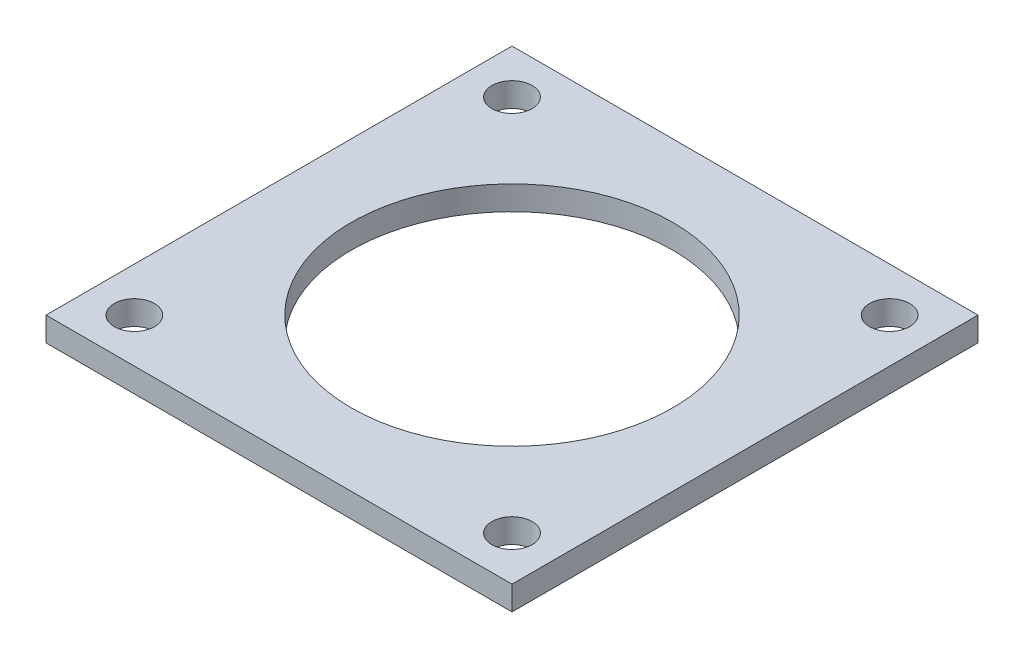
ISO-10303-21;
HEADER;
FILE_DESCRIPTION(('STEP AP214'),'2;1');
FILE_NAME('part.step','',(''),(''),'','','');
FILE_SCHEMA(('AUTOMOTIVE_DESIGN { 1 0 10303 214 1 1 1 1 }'));
ENDSEC;
DATA;
#1=APPLICATION_CONTEXT('core data for automotive mechanical design processes');
#2=APPLICATION_PROTOCOL_DEFINITION('international standard','automotive_design',2000,#1);
#3=PRODUCT_CONTEXT('',#1,'mechanical');
#4=PRODUCT('Part','Part','',(#3));
#5=PRODUCT_RELATED_PRODUCT_CATEGORY('part','',(#4));
#6=PRODUCT_DEFINITION_FORMATION('','',#4);
#7=PRODUCT_DEFINITION_CONTEXT('part definition',#1,'design');
#8=PRODUCT_DEFINITION('design','',#6,#7);
#9=PRODUCT_DEFINITION_SHAPE('','',#8);
#10=(LENGTH_UNIT() NAMED_UNIT(*) SI_UNIT(.MILLI.,.METRE.));
#11=(NAMED_UNIT(*) PLANE_ANGLE_UNIT() SI_UNIT($,.RADIAN.));
#12=(NAMED_UNIT(*) SI_UNIT($,.STERADIAN.) SOLID_ANGLE_UNIT());
#13=UNCERTAINTY_MEASURE_WITH_UNIT(LENGTH_MEASURE(1.E-05),#10,'distance_accuracy_value','');
#14=(GEOMETRIC_REPRESENTATION_CONTEXT(3) GLOBAL_UNCERTAINTY_ASSIGNED_CONTEXT((#13)) GLOBAL_UNIT_ASSIGNED_CONTEXT((#10,
#11,#12)) REPRESENTATION_CONTEXT('',''));
#15=CARTESIAN_POINT('',(0.,0.,0.));
#16=DIRECTION('',(0.,0.,1.));
#17=DIRECTION('',(1.,0.,0.));
#18=AXIS2_PLACEMENT_3D('',#15,#16,#17);
#19=CARTESIAN_POINT('',(0.,3.,0.));
#20=DIRECTION('',(0.,1.,0.));
#21=DIRECTION('',(0.,0.,1.));
#22=AXIS2_PLACEMENT_3D('',#19,#20,#21);
#23=PLANE('',#22);
#24=CARTESIAN_POINT('',(52.5,3.,52.5));
#25=DIRECTION('',(0.,1.,0.));
#26=DIRECTION('',(0.,0.,1.));
#27=AXIS2_PLACEMENT_3D('',#24,#25,#26);
#28=CIRCLE('',#27,2.5);
#29=CARTESIAN_POINT('',(52.5,3.,55.));
#30=VERTEX_POINT('',#29);
#31=EDGE_CURVE('E127',#30,#30,#28,.T.);
#32=ORIENTED_EDGE('',*,*,#31,.F.);
#33=EDGE_LOOP('',(#32));
#34=FACE_BOUND('',#33,.T.);
#35=CARTESIAN_POINT('',(5.5,3.,5.5));
#36=DIRECTION('',(0.,1.,0.));
#37=DIRECTION('',(0.,0.,1.));
#38=AXIS2_PLACEMENT_3D('',#35,#36,#37);
#39=CIRCLE('',#38,2.5);
#40=CARTESIAN_POINT('',(5.5,3.,8.));
#41=VERTEX_POINT('',#40);
#42=EDGE_CURVE('E115',#41,#41,#39,.T.);
#43=ORIENTED_EDGE('',*,*,#42,.F.);
#44=EDGE_LOOP('',(#43));
#45=FACE_BOUND('',#44,.T.);
#46=DIRECTION('',(0.,0.,1.));
#47=VECTOR('',#46,1.);
#48=CARTESIAN_POINT('',(0.,3.,0.));
#49=LINE('',#48,#47);
#50=CARTESIAN_POINT('',(0.,3.,0.));
#51=VERTEX_POINT('',#50);
#52=CARTESIAN_POINT('',(0.,3.,58.));
#53=VERTEX_POINT('',#52);
#54=EDGE_CURVE('E85',#51,#53,#49,.T.);
#55=ORIENTED_EDGE('',*,*,#54,.T.);
#56=DIRECTION('',(1.,0.,0.));
#57=VECTOR('',#56,1.);
#58=CARTESIAN_POINT('',(0.,3.,58.));
#59=LINE('',#58,#57);
#60=CARTESIAN_POINT('',(58.,3.,58.));
#61=VERTEX_POINT('',#60);
#62=EDGE_CURVE('E80',#53,#61,#59,.T.);
#63=ORIENTED_EDGE('',*,*,#62,.T.);
#64=DIRECTION('',(0.,0.,-1.));
#65=VECTOR('',#64,1.);
#66=CARTESIAN_POINT('',(58.,3.,0.));
#67=LINE('',#66,#65);
#68=CARTESIAN_POINT('',(58.,3.,0.));
#69=VERTEX_POINT('',#68);
#70=EDGE_CURVE('E83',#61,#69,#67,.T.);
#71=ORIENTED_EDGE('',*,*,#70,.T.);
#72=DIRECTION('',(-1.,0.,0.));
#73=VECTOR('',#72,1.);
#74=CARTESIAN_POINT('',(0.,3.,0.));
#75=LINE('',#74,#73);
#76=EDGE_CURVE('E50',#69,#51,#75,.T.);
#77=ORIENTED_EDGE('',*,*,#76,.T.);
#78=EDGE_LOOP('',(#55,#63,#71,#77));
#79=FACE_BOUND('',#78,.T.);
#80=CARTESIAN_POINT('',(29.,3.,29.));
#81=DIRECTION('',(0.,1.,0.));
#82=DIRECTION('',(0.,0.,1.));
#83=AXIS2_PLACEMENT_3D('',#80,#81,#82);
#84=CIRCLE('',#83,20.);
#85=CARTESIAN_POINT('',(29.,3.,49.));
#86=VERTEX_POINT('',#85);
#87=EDGE_CURVE('E100',#86,#86,#84,.T.);
#88=ORIENTED_EDGE('',*,*,#87,.F.);
#89=EDGE_LOOP('',(#88));
#90=FACE_BOUND('',#89,.T.);
#91=CARTESIAN_POINT('',(52.5,3.,5.5));
#92=DIRECTION('',(0.,1.,0.));
#93=DIRECTION('',(0.,0.,-1.));
#94=AXIS2_PLACEMENT_3D('',#91,#92,#93);
#95=CIRCLE('',#94,2.5);
#96=CARTESIAN_POINT('',(52.5,3.,3.));
#97=VERTEX_POINT('',#96);
#98=EDGE_CURVE('E121',#97,#97,#95,.T.);
#99=ORIENTED_EDGE('',*,*,#98,.F.);
#100=EDGE_LOOP('',(#99));
#101=FACE_BOUND('',#100,.T.);
#102=CARTESIAN_POINT('',(5.5,3.,52.5));
#103=DIRECTION('',(0.,1.,0.));
#104=DIRECTION('',(0.,0.,-1.));
#105=AXIS2_PLACEMENT_3D('',#102,#103,#104);
#106=CIRCLE('',#105,2.5);
#107=CARTESIAN_POINT('',(5.5,3.,50.));
#108=VERTEX_POINT('',#107);
#109=EDGE_CURVE('E133',#108,#108,#106,.T.);
#110=ORIENTED_EDGE('',*,*,#109,.F.);
#111=EDGE_LOOP('',(#110));
#112=FACE_BOUND('',#111,.T.);
#113=ADVANCED_FACE('F33',(#34,#45,#79,#90,#101,#112),#23,.T.);
#114=CARTESIAN_POINT('',(0.,0.,0.));
#115=DIRECTION('',(0.,1.,0.));
#116=DIRECTION('',(0.,0.,1.));
#117=AXIS2_PLACEMENT_3D('',#114,#115,#116);
#118=PLANE('',#117);
#119=CARTESIAN_POINT('',(52.5,0.,52.5));
#120=DIRECTION('',(0.,1.,0.));
#121=DIRECTION('',(0.,0.,1.));
#122=AXIS2_PLACEMENT_3D('',#119,#120,#121);
#123=CIRCLE('',#122,2.5);
#124=CARTESIAN_POINT('',(52.5,0.,55.));
#125=VERTEX_POINT('',#124);
#126=EDGE_CURVE('E130',#125,#125,#123,.T.);
#127=ORIENTED_EDGE('',*,*,#126,.T.);
#128=EDGE_LOOP('',(#127));
#129=FACE_BOUND('',#128,.T.);
#130=CARTESIAN_POINT('',(5.5,0.,5.5));
#131=DIRECTION('',(0.,1.,0.));
#132=DIRECTION('',(0.,0.,1.));
#133=AXIS2_PLACEMENT_3D('',#130,#131,#132);
#134=CIRCLE('',#133,2.5);
#135=CARTESIAN_POINT('',(5.5,0.,8.));
#136=VERTEX_POINT('',#135);
#137=EDGE_CURVE('E118',#136,#136,#134,.T.);
#138=ORIENTED_EDGE('',*,*,#137,.T.);
#139=EDGE_LOOP('',(#138));
#140=FACE_BOUND('',#139,.T.);
#141=DIRECTION('',(0.,0.,1.));
#142=VECTOR('',#141,1.);
#143=CARTESIAN_POINT('',(0.,0.,0.));
#144=LINE('',#143,#142);
#145=CARTESIAN_POINT('',(0.,0.,0.));
#146=VERTEX_POINT('',#145);
#147=CARTESIAN_POINT('',(0.,0.,58.));
#148=VERTEX_POINT('',#147);
#149=EDGE_CURVE('E97',#146,#148,#144,.T.);
#150=ORIENTED_EDGE('',*,*,#149,.F.);
#151=DIRECTION('',(-1.,0.,0.));
#152=VECTOR('',#151,1.);
#153=CARTESIAN_POINT('',(0.,0.,0.));
#154=LINE('',#153,#152);
#155=CARTESIAN_POINT('',(58.,0.,0.));
#156=VERTEX_POINT('',#155);
#157=EDGE_CURVE('E73',#156,#146,#154,.T.);
#158=ORIENTED_EDGE('',*,*,#157,.F.);
#159=DIRECTION('',(0.,0.,-1.));
#160=VECTOR('',#159,1.);
#161=CARTESIAN_POINT('',(58.,0.,0.));
#162=LINE('',#161,#160);
#163=CARTESIAN_POINT('',(58.,0.,58.));
#164=VERTEX_POINT('',#163);
#165=EDGE_CURVE('E67',#164,#156,#162,.T.);
#166=ORIENTED_EDGE('',*,*,#165,.F.);
#167=DIRECTION('',(1.,0.,0.));
#168=VECTOR('',#167,1.);
#169=CARTESIAN_POINT('',(0.,0.,58.));
#170=LINE('',#169,#168);
#171=EDGE_CURVE('E89',#148,#164,#170,.T.);
#172=ORIENTED_EDGE('',*,*,#171,.F.);
#173=EDGE_LOOP('',(#150,#158,#166,#172));
#174=FACE_BOUND('',#173,.T.);
#175=CARTESIAN_POINT('',(29.,0.,29.));
#176=DIRECTION('',(0.,1.,0.));
#177=DIRECTION('',(0.,0.,1.));
#178=AXIS2_PLACEMENT_3D('',#175,#176,#177);
#179=CIRCLE('',#178,20.);
#180=CARTESIAN_POINT('',(29.,0.,49.));
#181=VERTEX_POINT('',#180);
#182=EDGE_CURVE('E112',#181,#181,#179,.T.);
#183=ORIENTED_EDGE('',*,*,#182,.T.);
#184=EDGE_LOOP('',(#183));
#185=FACE_BOUND('',#184,.T.);
#186=CARTESIAN_POINT('',(52.5,0.,5.5));
#187=DIRECTION('',(0.,1.,0.));
#188=DIRECTION('',(0.,0.,-1.));
#189=AXIS2_PLACEMENT_3D('',#186,#187,#188);
#190=CIRCLE('',#189,2.5);
#191=CARTESIAN_POINT('',(52.5,0.,3.));
#192=VERTEX_POINT('',#191);
#193=EDGE_CURVE('E124',#192,#192,#190,.T.);
#194=ORIENTED_EDGE('',*,*,#193,.T.);
#195=EDGE_LOOP('',(#194));
#196=FACE_BOUND('',#195,.T.);
#197=CARTESIAN_POINT('',(5.5,0.,52.5));
#198=DIRECTION('',(0.,1.,0.));
#199=DIRECTION('',(0.,0.,-1.));
#200=AXIS2_PLACEMENT_3D('',#197,#198,#199);
#201=CIRCLE('',#200,2.5);
#202=CARTESIAN_POINT('',(5.5,0.,50.));
#203=VERTEX_POINT('',#202);
#204=EDGE_CURVE('E136',#203,#203,#201,.T.);
#205=ORIENTED_EDGE('',*,*,#204,.T.);
#206=EDGE_LOOP('',(#205));
#207=FACE_BOUND('',#206,.T.);
#208=ADVANCED_FACE('F108',(#129,#140,#174,#185,#196,#207),#118,.F.);
#209=CARTESIAN_POINT('',(0.,3.,0.));
#210=DIRECTION('',(1.,0.,0.));
#211=DIRECTION('',(0.,0.,-1.));
#212=AXIS2_PLACEMENT_3D('',#209,#210,#211);
#213=PLANE('',#212);
#214=ORIENTED_EDGE('',*,*,#149,.T.);
#215=DIRECTION('',(0.,-1.,0.));
#216=VECTOR('',#215,1.);
#217=CARTESIAN_POINT('',(0.,3.,58.));
#218=LINE('',#217,#216);
#219=EDGE_CURVE('E11',#53,#148,#218,.T.);
#220=ORIENTED_EDGE('',*,*,#219,.F.);
#221=ORIENTED_EDGE('',*,*,#54,.F.);
#222=DIRECTION('',(0.,-1.,0.));
#223=VECTOR('',#222,1.);
#224=CARTESIAN_POINT('',(0.,3.,0.));
#225=LINE('',#224,#223);
#226=EDGE_CURVE('E93',#51,#146,#225,.T.);
#227=ORIENTED_EDGE('',*,*,#226,.T.);
#228=EDGE_LOOP('',(#214,#220,#221,#227));
#229=FACE_BOUND('',#228,.T.);
#230=ADVANCED_FACE('F35',(#229),#213,.F.);
#231=CARTESIAN_POINT('',(0.,3.,58.));
#232=DIRECTION('',(0.,0.,-1.));
#233=DIRECTION('',(-1.,0.,0.));
#234=AXIS2_PLACEMENT_3D('',#231,#232,#233);
#235=PLANE('',#234);
#236=ORIENTED_EDGE('',*,*,#171,.T.);
#237=DIRECTION('',(0.,-1.,0.));
#238=VECTOR('',#237,1.);
#239=CARTESIAN_POINT('',(58.,3.,58.));
#240=LINE('',#239,#238);
#241=EDGE_CURVE('E42',#61,#164,#240,.T.);
#242=ORIENTED_EDGE('',*,*,#241,.F.);
#243=ORIENTED_EDGE('',*,*,#62,.F.);
#244=ORIENTED_EDGE('',*,*,#219,.T.);
#245=EDGE_LOOP('',(#236,#242,#243,#244));
#246=FACE_BOUND('',#245,.T.);
#247=ADVANCED_FACE('F88',(#246),#235,.F.);
#248=CARTESIAN_POINT('',(58.,3.,0.));
#249=DIRECTION('',(-1.,0.,0.));
#250=DIRECTION('',(0.,0.,1.));
#251=AXIS2_PLACEMENT_3D('',#248,#249,#250);
#252=PLANE('',#251);
#253=ORIENTED_EDGE('',*,*,#165,.T.);
#254=DIRECTION('',(0.,-1.,0.));
#255=VECTOR('',#254,1.);
#256=CARTESIAN_POINT('',(58.,3.,0.));
#257=LINE('',#256,#255);
#258=EDGE_CURVE('E90',#69,#156,#257,.T.);
#259=ORIENTED_EDGE('',*,*,#258,.F.);
#260=ORIENTED_EDGE('',*,*,#70,.F.);
#261=ORIENTED_EDGE('',*,*,#241,.T.);
#262=EDGE_LOOP('',(#253,#259,#260,#261));
#263=FACE_BOUND('',#262,.T.);
#264=ADVANCED_FACE('F91',(#263),#252,.F.);
#265=CARTESIAN_POINT('',(0.,3.,0.));
#266=DIRECTION('',(0.,0.,1.));
#267=DIRECTION('',(1.,0.,0.));
#268=AXIS2_PLACEMENT_3D('',#265,#266,#267);
#269=PLANE('',#268);
#270=ORIENTED_EDGE('',*,*,#157,.T.);
#271=ORIENTED_EDGE('',*,*,#226,.F.);
#272=ORIENTED_EDGE('',*,*,#76,.F.);
#273=ORIENTED_EDGE('',*,*,#258,.T.);
#274=EDGE_LOOP('',(#270,#271,#272,#273));
#275=FACE_BOUND('',#274,.T.);
#276=ADVANCED_FACE('F105',(#275),#269,.F.);
#277=CARTESIAN_POINT('',(29.,3.,29.));
#278=DIRECTION('',(0.,-1.,0.));
#279=DIRECTION('',(0.,0.,-1.));
#280=AXIS2_PLACEMENT_3D('',#277,#278,#279);
#281=CYLINDRICAL_SURFACE('',#280,20.);
#282=ORIENTED_EDGE('',*,*,#87,.T.);
#283=EDGE_LOOP('',(#282));
#284=FACE_BOUND('',#283,.T.);
#285=ORIENTED_EDGE('',*,*,#182,.F.);
#286=EDGE_LOOP('',(#285));
#287=FACE_BOUND('',#286,.T.);
#288=ADVANCED_FACE('F156',(#284,#287),#281,.F.);
#289=CARTESIAN_POINT('',(5.5,3.,5.5));
#290=DIRECTION('',(0.,-1.,0.));
#291=DIRECTION('',(0.,0.,-1.));
#292=AXIS2_PLACEMENT_3D('',#289,#290,#291);
#293=CYLINDRICAL_SURFACE('',#292,2.5);
#294=ORIENTED_EDGE('',*,*,#42,.T.);
#295=EDGE_LOOP('',(#294));
#296=FACE_BOUND('',#295,.T.);
#297=ORIENTED_EDGE('',*,*,#137,.F.);
#298=EDGE_LOOP('',(#297));
#299=FACE_BOUND('',#298,.T.);
#300=ADVANCED_FACE('F202',(#296,#299),#293,.F.);
#301=CARTESIAN_POINT('',(52.5,3.,5.5));
#302=DIRECTION('',(0.,-1.,0.));
#303=DIRECTION('',(0.,0.,-1.));
#304=AXIS2_PLACEMENT_3D('',#301,#302,#303);
#305=CYLINDRICAL_SURFACE('',#304,2.5);
#306=ORIENTED_EDGE('',*,*,#98,.T.);
#307=EDGE_LOOP('',(#306));
#308=FACE_BOUND('',#307,.T.);
#309=ORIENTED_EDGE('',*,*,#193,.F.);
#310=EDGE_LOOP('',(#309));
#311=FACE_BOUND('',#310,.T.);
#312=ADVANCED_FACE('F210',(#308,#311),#305,.F.);
#313=CARTESIAN_POINT('',(52.5,3.,52.5));
#314=DIRECTION('',(0.,-1.,0.));
#315=DIRECTION('',(0.,0.,-1.));
#316=AXIS2_PLACEMENT_3D('',#313,#314,#315);
#317=CYLINDRICAL_SURFACE('',#316,2.5);
#318=ORIENTED_EDGE('',*,*,#31,.T.);
#319=EDGE_LOOP('',(#318));
#320=FACE_BOUND('',#319,.T.);
#321=ORIENTED_EDGE('',*,*,#126,.F.);
#322=EDGE_LOOP('',(#321));
#323=FACE_BOUND('',#322,.T.);
#324=ADVANCED_FACE('F218',(#320,#323),#317,.F.);
#325=CARTESIAN_POINT('',(5.5,3.,52.5));
#326=DIRECTION('',(0.,-1.,0.));
#327=DIRECTION('',(0.,0.,-1.));
#328=AXIS2_PLACEMENT_3D('',#325,#326,#327);
#329=CYLINDRICAL_SURFACE('',#328,2.5);
#330=ORIENTED_EDGE('',*,*,#109,.T.);
#331=EDGE_LOOP('',(#330));
#332=FACE_BOUND('',#331,.T.);
#333=ORIENTED_EDGE('',*,*,#204,.F.);
#334=EDGE_LOOP('',(#333));
#335=FACE_BOUND('',#334,.T.);
#336=ADVANCED_FACE('F142',(#332,#335),#329,.F.);
#337=CLOSED_SHELL('',(#113,#208,#230,#247,#264,#276,#288,#300,#312,#324,#336));
#338=MANIFOLD_SOLID_BREP('B2',#337);
#339=ADVANCED_BREP_SHAPE_REPRESENTATION('',(#18,#338),#14);
#340=SHAPE_DEFINITION_REPRESENTATION(#9,#339);
ENDSEC;
END-ISO-10303-21;
